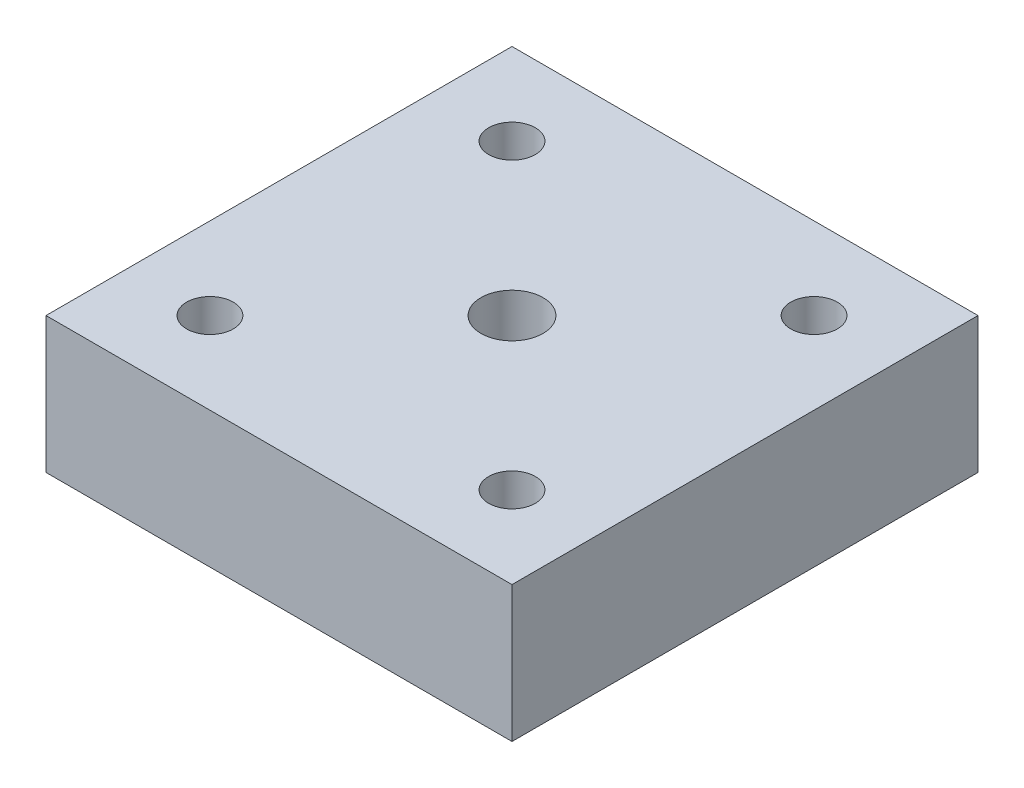
ISO-10303-21;
HEADER;
FILE_DESCRIPTION(('STEP AP214'),'2;1');
FILE_NAME('part.step','',(''),(''),'','','');
FILE_SCHEMA(('AUTOMOTIVE_DESIGN { 1 0 10303 214 1 1 1 1 }'));
ENDSEC;
DATA;
#1=APPLICATION_CONTEXT('core data for automotive mechanical design processes');
#2=APPLICATION_PROTOCOL_DEFINITION('international standard','automotive_design',2000,#1);
#3=PRODUCT_CONTEXT('',#1,'mechanical');
#4=PRODUCT('Part','Part','',(#3));
#5=PRODUCT_RELATED_PRODUCT_CATEGORY('part','',(#4));
#6=PRODUCT_DEFINITION_FORMATION('','',#4);
#7=PRODUCT_DEFINITION_CONTEXT('part definition',#1,'design');
#8=PRODUCT_DEFINITION('design','',#6,#7);
#9=PRODUCT_DEFINITION_SHAPE('','',#8);
#10=(LENGTH_UNIT() NAMED_UNIT(*) SI_UNIT(.MILLI.,.METRE.));
#11=(NAMED_UNIT(*) PLANE_ANGLE_UNIT() SI_UNIT($,.RADIAN.));
#12=(NAMED_UNIT(*) SI_UNIT($,.STERADIAN.) SOLID_ANGLE_UNIT());
#13=UNCERTAINTY_MEASURE_WITH_UNIT(LENGTH_MEASURE(1.E-05),#10,'distance_accuracy_value','');
#14=(GEOMETRIC_REPRESENTATION_CONTEXT(3) GLOBAL_UNCERTAINTY_ASSIGNED_CONTEXT((#13)) GLOBAL_UNIT_ASSIGNED_CONTEXT((#10,
#11,#12)) REPRESENTATION_CONTEXT('',''));
#15=CARTESIAN_POINT('',(0.,0.,0.));
#16=DIRECTION('',(0.,0.,1.));
#17=DIRECTION('',(1.,0.,0.));
#18=AXIS2_PLACEMENT_3D('',#15,#16,#17);
#19=CARTESIAN_POINT('',(0.,35.,0.));
#20=DIRECTION('',(0.,1.,0.));
#21=DIRECTION('',(0.,0.,1.));
#22=AXIS2_PLACEMENT_3D('',#19,#20,#21);
#23=PLANE('',#22);
#24=CARTESIAN_POINT('',(-38.8908729652601,35.,-38.8908729652601));
#25=DIRECTION('',(0.,1.,0.));
#26=DIRECTION('',(0.,0.,1.));
#27=AXIS2_PLACEMENT_3D('',#24,#25,#26);
#28=CIRCLE('',#27,6.00000000000001);
#29=CARTESIAN_POINT('',(-38.8908729652601,35.,-32.8908729652601));
#30=VERTEX_POINT('',#29);
#31=EDGE_CURVE('E127',#30,#30,#28,.T.);
#32=ORIENTED_EDGE('',*,*,#31,.F.);
#33=EDGE_LOOP('',(#32));
#34=FACE_BOUND('',#33,.T.);
#35=CARTESIAN_POINT('',(-38.8908729652601,35.,38.8908729652601));
#36=DIRECTION('',(0.,1.,0.));
#37=DIRECTION('',(0.,0.,1.));
#38=AXIS2_PLACEMENT_3D('',#35,#36,#37);
#39=CIRCLE('',#38,5.99999999999999);
#40=CARTESIAN_POINT('',(-38.8908729652601,35.,44.8908729652601));
#41=VERTEX_POINT('',#40);
#42=EDGE_CURVE('E115',#41,#41,#39,.T.);
#43=ORIENTED_EDGE('',*,*,#42,.F.);
#44=EDGE_LOOP('',(#43));
#45=FACE_BOUND('',#44,.T.);
#46=DIRECTION('',(0.,0.,1.));
#47=VECTOR('',#46,1.);
#48=CARTESIAN_POINT('',(-60.,35.,-60.));
#49=LINE('',#48,#47);
#50=CARTESIAN_POINT('',(-60.,35.,-60.));
#51=VERTEX_POINT('',#50);
#52=CARTESIAN_POINT('',(-60.,35.,60.));
#53=VERTEX_POINT('',#52);
#54=EDGE_CURVE('E85',#51,#53,#49,.T.);
#55=ORIENTED_EDGE('',*,*,#54,.T.);
#56=DIRECTION('',(1.,0.,0.));
#57=VECTOR('',#56,1.);
#58=CARTESIAN_POINT('',(-60.,35.,60.));
#59=LINE('',#58,#57);
#60=CARTESIAN_POINT('',(60.,35.,60.));
#61=VERTEX_POINT('',#60);
#62=EDGE_CURVE('E80',#53,#61,#59,.T.);
#63=ORIENTED_EDGE('',*,*,#62,.T.);
#64=DIRECTION('',(0.,0.,-1.));
#65=VECTOR('',#64,1.);
#66=CARTESIAN_POINT('',(60.,35.,-60.));
#67=LINE('',#66,#65);
#68=CARTESIAN_POINT('',(60.,35.,-60.));
#69=VERTEX_POINT('',#68);
#70=EDGE_CURVE('E83',#61,#69,#67,.T.);
#71=ORIENTED_EDGE('',*,*,#70,.T.);
#72=DIRECTION('',(-1.,0.,0.));
#73=VECTOR('',#72,1.);
#74=CARTESIAN_POINT('',(-60.,35.,-60.));
#75=LINE('',#74,#73);
#76=EDGE_CURVE('E50',#69,#51,#75,.T.);
#77=ORIENTED_EDGE('',*,*,#76,.T.);
#78=EDGE_LOOP('',(#55,#63,#71,#77));
#79=FACE_BOUND('',#78,.T.);
#80=CARTESIAN_POINT('',(0.,35.,0.));
#81=DIRECTION('',(0.,1.,0.));
#82=DIRECTION('',(0.,0.,1.));
#83=AXIS2_PLACEMENT_3D('',#80,#81,#82);
#84=CIRCLE('',#83,8.);
#85=CARTESIAN_POINT('',(0.,35.,8.));
#86=VERTEX_POINT('',#85);
#87=EDGE_CURVE('E100',#86,#86,#84,.T.);
#88=ORIENTED_EDGE('',*,*,#87,.F.);
#89=EDGE_LOOP('',(#88));
#90=FACE_BOUND('',#89,.T.);
#91=CARTESIAN_POINT('',(38.8908729652601,35.,38.8908729652601));
#92=DIRECTION('',(0.,1.,0.));
#93=DIRECTION('',(0.,0.,1.));
#94=AXIS2_PLACEMENT_3D('',#91,#92,#93);
#95=CIRCLE('',#94,5.99999999999999);
#96=CARTESIAN_POINT('',(38.8908729652601,35.,44.8908729652601));
#97=VERTEX_POINT('',#96);
#98=EDGE_CURVE('E121',#97,#97,#95,.T.);
#99=ORIENTED_EDGE('',*,*,#98,.F.);
#100=EDGE_LOOP('',(#99));
#101=FACE_BOUND('',#100,.T.);
#102=CARTESIAN_POINT('',(38.8908729652601,35.,-38.8908729652601));
#103=DIRECTION('',(0.,1.,0.));
#104=DIRECTION('',(0.,0.,1.));
#105=AXIS2_PLACEMENT_3D('',#102,#103,#104);
#106=CIRCLE('',#105,6.00000000000001);
#107=CARTESIAN_POINT('',(38.8908729652601,35.,-32.8908729652601));
#108=VERTEX_POINT('',#107);
#109=EDGE_CURVE('E133',#108,#108,#106,.T.);
#110=ORIENTED_EDGE('',*,*,#109,.F.);
#111=EDGE_LOOP('',(#110));
#112=FACE_BOUND('',#111,.T.);
#113=ADVANCED_FACE('F33',(#34,#45,#79,#90,#101,#112),#23,.T.);
#114=CARTESIAN_POINT('',(0.,0.,0.));
#115=DIRECTION('',(0.,1.,0.));
#116=DIRECTION('',(0.,0.,1.));
#117=AXIS2_PLACEMENT_3D('',#114,#115,#116);
#118=PLANE('',#117);
#119=DIRECTION('',(0.,0.,1.));
#120=VECTOR('',#119,1.);
#121=CARTESIAN_POINT('',(-60.,0.,-60.));
#122=LINE('',#121,#120);
#123=CARTESIAN_POINT('',(-60.,0.,-60.));
#124=VERTEX_POINT('',#123);
#125=CARTESIAN_POINT('',(-60.,0.,60.));
#126=VERTEX_POINT('',#125);
#127=EDGE_CURVE('E97',#124,#126,#122,.T.);
#128=ORIENTED_EDGE('',*,*,#127,.F.);
#129=DIRECTION('',(-1.,0.,0.));
#130=VECTOR('',#129,1.);
#131=CARTESIAN_POINT('',(-60.,0.,-60.));
#132=LINE('',#131,#130);
#133=CARTESIAN_POINT('',(60.,0.,-60.));
#134=VERTEX_POINT('',#133);
#135=EDGE_CURVE('E73',#134,#124,#132,.T.);
#136=ORIENTED_EDGE('',*,*,#135,.F.);
#137=DIRECTION('',(0.,0.,-1.));
#138=VECTOR('',#137,1.);
#139=CARTESIAN_POINT('',(60.,0.,-60.));
#140=LINE('',#139,#138);
#141=CARTESIAN_POINT('',(60.,0.,60.));
#142=VERTEX_POINT('',#141);
#143=EDGE_CURVE('E67',#142,#134,#140,.T.);
#144=ORIENTED_EDGE('',*,*,#143,.F.);
#145=DIRECTION('',(1.,0.,0.));
#146=VECTOR('',#145,1.);
#147=CARTESIAN_POINT('',(-60.,0.,60.));
#148=LINE('',#147,#146);
#149=EDGE_CURVE('E89',#126,#142,#148,.T.);
#150=ORIENTED_EDGE('',*,*,#149,.F.);
#151=EDGE_LOOP('',(#128,#136,#144,#150));
#152=FACE_BOUND('',#151,.T.);
#153=CARTESIAN_POINT('',(0.,0.,0.));
#154=DIRECTION('',(0.,1.,0.));
#155=DIRECTION('',(0.,0.,1.));
#156=AXIS2_PLACEMENT_3D('',#153,#154,#155);
#157=CIRCLE('',#156,8.);
#158=CARTESIAN_POINT('',(0.,0.,8.));
#159=VERTEX_POINT('',#158);
#160=EDGE_CURVE('E112',#159,#159,#157,.T.);
#161=ORIENTED_EDGE('',*,*,#160,.T.);
#162=EDGE_LOOP('',(#161));
#163=FACE_BOUND('',#162,.T.);
#164=CARTESIAN_POINT('',(-38.8908729652601,0.,38.8908729652601));
#165=DIRECTION('',(0.,1.,0.));
#166=DIRECTION('',(0.,0.,1.));
#167=AXIS2_PLACEMENT_3D('',#164,#165,#166);
#168=CIRCLE('',#167,5.99999999999999);
#169=CARTESIAN_POINT('',(-38.8908729652601,0.,44.8908729652601));
#170=VERTEX_POINT('',#169);
#171=EDGE_CURVE('E118',#170,#170,#168,.T.);
#172=ORIENTED_EDGE('',*,*,#171,.T.);
#173=EDGE_LOOP('',(#172));
#174=FACE_BOUND('',#173,.T.);
#175=CARTESIAN_POINT('',(38.8908729652601,0.,38.8908729652601));
#176=DIRECTION('',(0.,1.,0.));
#177=DIRECTION('',(0.,0.,1.));
#178=AXIS2_PLACEMENT_3D('',#175,#176,#177);
#179=CIRCLE('',#178,5.99999999999999);
#180=CARTESIAN_POINT('',(38.8908729652601,0.,44.8908729652601));
#181=VERTEX_POINT('',#180);
#182=EDGE_CURVE('E124',#181,#181,#179,.T.);
#183=ORIENTED_EDGE('',*,*,#182,.T.);
#184=EDGE_LOOP('',(#183));
#185=FACE_BOUND('',#184,.T.);
#186=CARTESIAN_POINT('',(-38.8908729652601,0.,-38.8908729652601));
#187=DIRECTION('',(0.,1.,0.));
#188=DIRECTION('',(0.,0.,1.));
#189=AXIS2_PLACEMENT_3D('',#186,#187,#188);
#190=CIRCLE('',#189,6.00000000000001);
#191=CARTESIAN_POINT('',(-38.8908729652601,0.,-32.8908729652601));
#192=VERTEX_POINT('',#191);
#193=EDGE_CURVE('E130',#192,#192,#190,.T.);
#194=ORIENTED_EDGE('',*,*,#193,.T.);
#195=EDGE_LOOP('',(#194));
#196=FACE_BOUND('',#195,.T.);
#197=CARTESIAN_POINT('',(38.8908729652601,0.,-38.8908729652601));
#198=DIRECTION('',(0.,1.,0.));
#199=DIRECTION('',(0.,0.,1.));
#200=AXIS2_PLACEMENT_3D('',#197,#198,#199);
#201=CIRCLE('',#200,6.00000000000001);
#202=CARTESIAN_POINT('',(38.8908729652601,0.,-32.8908729652601));
#203=VERTEX_POINT('',#202);
#204=EDGE_CURVE('E136',#203,#203,#201,.T.);
#205=ORIENTED_EDGE('',*,*,#204,.T.);
#206=EDGE_LOOP('',(#205));
#207=FACE_BOUND('',#206,.T.);
#208=ADVANCED_FACE('F108',(#152,#163,#174,#185,#196,#207),#118,.F.);
#209=CARTESIAN_POINT('',(-60.,35.,-60.));
#210=DIRECTION('',(1.,0.,0.));
#211=DIRECTION('',(0.,0.,-1.));
#212=AXIS2_PLACEMENT_3D('',#209,#210,#211);
#213=PLANE('',#212);
#214=ORIENTED_EDGE('',*,*,#127,.T.);
#215=DIRECTION('',(0.,-1.,0.));
#216=VECTOR('',#215,1.);
#217=CARTESIAN_POINT('',(-60.,35.,60.));
#218=LINE('',#217,#216);
#219=EDGE_CURVE('E11',#53,#126,#218,.T.);
#220=ORIENTED_EDGE('',*,*,#219,.F.);
#221=ORIENTED_EDGE('',*,*,#54,.F.);
#222=DIRECTION('',(0.,-1.,0.));
#223=VECTOR('',#222,1.);
#224=CARTESIAN_POINT('',(-60.,35.,-60.));
#225=LINE('',#224,#223);
#226=EDGE_CURVE('E93',#51,#124,#225,.T.);
#227=ORIENTED_EDGE('',*,*,#226,.T.);
#228=EDGE_LOOP('',(#214,#220,#221,#227));
#229=FACE_BOUND('',#228,.T.);
#230=ADVANCED_FACE('F35',(#229),#213,.F.);
#231=CARTESIAN_POINT('',(-60.,35.,60.));
#232=DIRECTION('',(0.,0.,-1.));
#233=DIRECTION('',(-1.,0.,0.));
#234=AXIS2_PLACEMENT_3D('',#231,#232,#233);
#235=PLANE('',#234);
#236=ORIENTED_EDGE('',*,*,#149,.T.);
#237=DIRECTION('',(0.,-1.,0.));
#238=VECTOR('',#237,1.);
#239=CARTESIAN_POINT('',(60.,35.,60.));
#240=LINE('',#239,#238);
#241=EDGE_CURVE('E42',#61,#142,#240,.T.);
#242=ORIENTED_EDGE('',*,*,#241,.F.);
#243=ORIENTED_EDGE('',*,*,#62,.F.);
#244=ORIENTED_EDGE('',*,*,#219,.T.);
#245=EDGE_LOOP('',(#236,#242,#243,#244));
#246=FACE_BOUND('',#245,.T.);
#247=ADVANCED_FACE('F88',(#246),#235,.F.);
#248=CARTESIAN_POINT('',(60.,35.,-60.));
#249=DIRECTION('',(-1.,0.,0.));
#250=DIRECTION('',(0.,0.,1.));
#251=AXIS2_PLACEMENT_3D('',#248,#249,#250);
#252=PLANE('',#251);
#253=ORIENTED_EDGE('',*,*,#143,.T.);
#254=DIRECTION('',(0.,-1.,0.));
#255=VECTOR('',#254,1.);
#256=CARTESIAN_POINT('',(60.,35.,-60.));
#257=LINE('',#256,#255);
#258=EDGE_CURVE('E90',#69,#134,#257,.T.);
#259=ORIENTED_EDGE('',*,*,#258,.F.);
#260=ORIENTED_EDGE('',*,*,#70,.F.);
#261=ORIENTED_EDGE('',*,*,#241,.T.);
#262=EDGE_LOOP('',(#253,#259,#260,#261));
#263=FACE_BOUND('',#262,.T.);
#264=ADVANCED_FACE('F91',(#263),#252,.F.);
#265=CARTESIAN_POINT('',(-60.,35.,-60.));
#266=DIRECTION('',(0.,0.,1.));
#267=DIRECTION('',(1.,0.,0.));
#268=AXIS2_PLACEMENT_3D('',#265,#266,#267);
#269=PLANE('',#268);
#270=ORIENTED_EDGE('',*,*,#135,.T.);
#271=ORIENTED_EDGE('',*,*,#226,.F.);
#272=ORIENTED_EDGE('',*,*,#76,.F.);
#273=ORIENTED_EDGE('',*,*,#258,.T.);
#274=EDGE_LOOP('',(#270,#271,#272,#273));
#275=FACE_BOUND('',#274,.T.);
#276=ADVANCED_FACE('F105',(#275),#269,.F.);
#277=CARTESIAN_POINT('',(0.,35.,0.));
#278=DIRECTION('',(0.,-1.,0.));
#279=DIRECTION('',(0.,0.,-1.));
#280=AXIS2_PLACEMENT_3D('',#277,#278,#279);
#281=CYLINDRICAL_SURFACE('',#280,8.);
#282=ORIENTED_EDGE('',*,*,#87,.T.);
#283=EDGE_LOOP('',(#282));
#284=FACE_BOUND('',#283,.T.);
#285=ORIENTED_EDGE('',*,*,#160,.F.);
#286=EDGE_LOOP('',(#285));
#287=FACE_BOUND('',#286,.T.);
#288=ADVANCED_FACE('F155',(#284,#287),#281,.F.);
#289=CARTESIAN_POINT('',(-38.8908729652601,35.,38.8908729652601));
#290=DIRECTION('',(0.,-1.,0.));
#291=DIRECTION('',(0.,0.,-1.));
#292=AXIS2_PLACEMENT_3D('',#289,#290,#291);
#293=CYLINDRICAL_SURFACE('',#292,5.99999999999999);
#294=ORIENTED_EDGE('',*,*,#42,.T.);
#295=EDGE_LOOP('',(#294));
#296=FACE_BOUND('',#295,.T.);
#297=ORIENTED_EDGE('',*,*,#171,.F.);
#298=EDGE_LOOP('',(#297));
#299=FACE_BOUND('',#298,.T.);
#300=ADVANCED_FACE('F201',(#296,#299),#293,.F.);
#301=CARTESIAN_POINT('',(38.8908729652601,35.,38.8908729652601));
#302=DIRECTION('',(0.,-1.,0.));
#303=DIRECTION('',(0.,0.,-1.));
#304=AXIS2_PLACEMENT_3D('',#301,#302,#303);
#305=CYLINDRICAL_SURFACE('',#304,5.99999999999999);
#306=ORIENTED_EDGE('',*,*,#98,.T.);
#307=EDGE_LOOP('',(#306));
#308=FACE_BOUND('',#307,.T.);
#309=ORIENTED_EDGE('',*,*,#182,.F.);
#310=EDGE_LOOP('',(#309));
#311=FACE_BOUND('',#310,.T.);
#312=ADVANCED_FACE('F209',(#308,#311),#305,.F.);
#313=CARTESIAN_POINT('',(-38.8908729652601,35.,-38.8908729652601));
#314=DIRECTION('',(0.,-1.,0.));
#315=DIRECTION('',(0.,0.,-1.));
#316=AXIS2_PLACEMENT_3D('',#313,#314,#315);
#317=CYLINDRICAL_SURFACE('',#316,6.00000000000001);
#318=ORIENTED_EDGE('',*,*,#31,.T.);
#319=EDGE_LOOP('',(#318));
#320=FACE_BOUND('',#319,.T.);
#321=ORIENTED_EDGE('',*,*,#193,.F.);
#322=EDGE_LOOP('',(#321));
#323=FACE_BOUND('',#322,.T.);
#324=ADVANCED_FACE('F217',(#320,#323),#317,.F.);
#325=CARTESIAN_POINT('',(38.8908729652601,35.,-38.8908729652601));
#326=DIRECTION('',(0.,-1.,0.));
#327=DIRECTION('',(0.,0.,-1.));
#328=AXIS2_PLACEMENT_3D('',#325,#326,#327);
#329=CYLINDRICAL_SURFACE('',#328,6.00000000000001);
#330=ORIENTED_EDGE('',*,*,#109,.T.);
#331=EDGE_LOOP('',(#330));
#332=FACE_BOUND('',#331,.T.);
#333=ORIENTED_EDGE('',*,*,#204,.F.);
#334=EDGE_LOOP('',(#333));
#335=FACE_BOUND('',#334,.T.);
#336=ADVANCED_FACE('F142',(#332,#335),#329,.F.);
#337=CLOSED_SHELL('',(#113,#208,#230,#247,#264,#276,#288,#300,#312,#324,#336));
#338=MANIFOLD_SOLID_BREP('B2',#337);
#339=ADVANCED_BREP_SHAPE_REPRESENTATION('',(#18,#338),#14);
#340=SHAPE_DEFINITION_REPRESENTATION(#9,#339);
ENDSEC;
END-ISO-10303-21;
